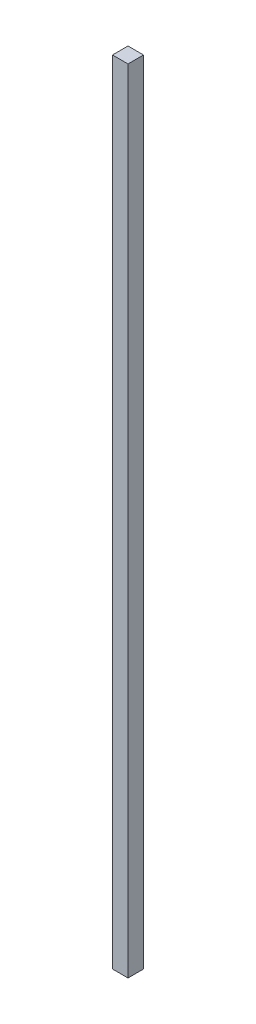
ISO-10303-21;
HEADER;
FILE_DESCRIPTION(('STEP AP214'),'2;1');
FILE_NAME('part.step','',(''),(''),'','','');
FILE_SCHEMA(('AUTOMOTIVE_DESIGN { 1 0 10303 214 1 1 1 1 }'));
ENDSEC;
DATA;
#1=APPLICATION_CONTEXT('core data for automotive mechanical design processes');
#2=APPLICATION_PROTOCOL_DEFINITION('international standard','automotive_design',2000,#1);
#3=PRODUCT_CONTEXT('',#1,'mechanical');
#4=PRODUCT('Part','Part','',(#3));
#5=PRODUCT_RELATED_PRODUCT_CATEGORY('part','',(#4));
#6=PRODUCT_DEFINITION_FORMATION('','',#4);
#7=PRODUCT_DEFINITION_CONTEXT('part definition',#1,'design');
#8=PRODUCT_DEFINITION('design','',#6,#7);
#9=PRODUCT_DEFINITION_SHAPE('','',#8);
#10=(LENGTH_UNIT() NAMED_UNIT(*) SI_UNIT(.MILLI.,.METRE.));
#11=(NAMED_UNIT(*) PLANE_ANGLE_UNIT() SI_UNIT($,.RADIAN.));
#12=(NAMED_UNIT(*) SI_UNIT($,.STERADIAN.) SOLID_ANGLE_UNIT());
#13=UNCERTAINTY_MEASURE_WITH_UNIT(LENGTH_MEASURE(1.E-05),#10,'distance_accuracy_value','');
#14=(GEOMETRIC_REPRESENTATION_CONTEXT(3) GLOBAL_UNCERTAINTY_ASSIGNED_CONTEXT((#13)) GLOBAL_UNIT_ASSIGNED_CONTEXT((#10,
#11,#12)) REPRESENTATION_CONTEXT('',''));
#15=CARTESIAN_POINT('',(0.,0.,0.));
#16=DIRECTION('',(0.,0.,1.));
#17=DIRECTION('',(1.,0.,0.));
#18=AXIS2_PLACEMENT_3D('',#15,#16,#17);
#19=CARTESIAN_POINT('',(2.5,255.,-2.5));
#20=DIRECTION('',(-1.,0.,0.));
#21=DIRECTION('',(0.,0.,1.));
#22=AXIS2_PLACEMENT_3D('',#19,#20,#21);
#23=PLANE('',#22);
#24=DIRECTION('',(0.,0.,-1.));
#25=VECTOR('',#24,1.);
#26=CARTESIAN_POINT('',(2.5,0.,-2.5));
#27=LINE('',#26,#25);
#28=CARTESIAN_POINT('',(2.5,0.,2.5));
#29=VERTEX_POINT('',#28);
#30=CARTESIAN_POINT('',(2.5,0.,-2.5));
#31=VERTEX_POINT('',#30);
#32=EDGE_CURVE('E100',#29,#31,#27,.T.);
#33=ORIENTED_EDGE('',*,*,#32,.T.);
#34=DIRECTION('',(0.,-1.,0.));
#35=VECTOR('',#34,1.);
#36=CARTESIAN_POINT('',(2.5,255.,-2.5));
#37=LINE('',#36,#35);
#38=CARTESIAN_POINT('',(2.5,255.,-2.5));
#39=VERTEX_POINT('',#38);
#40=EDGE_CURVE('E11',#39,#31,#37,.T.);
#41=ORIENTED_EDGE('',*,*,#40,.F.);
#42=DIRECTION('',(0.,0.,-1.));
#43=VECTOR('',#42,1.);
#44=CARTESIAN_POINT('',(2.5,255.,-2.5));
#45=LINE('',#44,#43);
#46=CARTESIAN_POINT('',(2.5,255.,2.5));
#47=VERTEX_POINT('',#46);
#48=EDGE_CURVE('E88',#47,#39,#45,.T.);
#49=ORIENTED_EDGE('',*,*,#48,.F.);
#50=DIRECTION('',(0.,-1.,0.));
#51=VECTOR('',#50,1.);
#52=CARTESIAN_POINT('',(2.5,255.,2.5));
#53=LINE('',#52,#51);
#54=EDGE_CURVE('E96',#47,#29,#53,.T.);
#55=ORIENTED_EDGE('',*,*,#54,.T.);
#56=EDGE_LOOP('',(#33,#41,#49,#55));
#57=FACE_BOUND('',#56,.T.);
#58=ADVANCED_FACE('F37',(#57),#23,.F.);
#59=CARTESIAN_POINT('',(-2.50000000000001,255.,-2.5));
#60=DIRECTION('',(0.,0.,1.));
#61=DIRECTION('',(1.,0.,0.));
#62=AXIS2_PLACEMENT_3D('',#59,#60,#61);
#63=PLANE('',#62);
#64=DIRECTION('',(-1.,0.,0.));
#65=VECTOR('',#64,1.);
#66=CARTESIAN_POINT('',(-2.50000000000001,0.,-2.5));
#67=LINE('',#66,#65);
#68=CARTESIAN_POINT('',(-2.50000000000001,0.,-2.5));
#69=VERTEX_POINT('',#68);
#70=EDGE_CURVE('E92',#31,#69,#67,.T.);
#71=ORIENTED_EDGE('',*,*,#70,.T.);
#72=DIRECTION('',(0.,-1.,0.));
#73=VECTOR('',#72,1.);
#74=CARTESIAN_POINT('',(-2.50000000000001,255.,-2.5));
#75=LINE('',#74,#73);
#76=CARTESIAN_POINT('',(-2.50000000000001,255.,-2.5));
#77=VERTEX_POINT('',#76);
#78=EDGE_CURVE('E45',#77,#69,#75,.T.);
#79=ORIENTED_EDGE('',*,*,#78,.F.);
#80=DIRECTION('',(-1.,0.,0.));
#81=VECTOR('',#80,1.);
#82=CARTESIAN_POINT('',(-2.50000000000001,255.,-2.5));
#83=LINE('',#82,#81);
#84=EDGE_CURVE('E83',#39,#77,#83,.T.);
#85=ORIENTED_EDGE('',*,*,#84,.F.);
#86=ORIENTED_EDGE('',*,*,#40,.T.);
#87=EDGE_LOOP('',(#71,#79,#85,#86));
#88=FACE_BOUND('',#87,.T.);
#89=ADVANCED_FACE('F91',(#88),#63,.F.);
#90=CARTESIAN_POINT('',(-2.50000000000001,255.,-2.5));
#91=DIRECTION('',(1.,0.,0.));
#92=DIRECTION('',(0.,0.,-1.));
#93=AXIS2_PLACEMENT_3D('',#90,#91,#92);
#94=PLANE('',#93);
#95=DIRECTION('',(0.,0.,1.));
#96=VECTOR('',#95,1.);
#97=CARTESIAN_POINT('',(-2.50000000000001,0.,-2.5));
#98=LINE('',#97,#96);
#99=CARTESIAN_POINT('',(-2.50000000000001,0.,2.5));
#100=VERTEX_POINT('',#99);
#101=EDGE_CURVE('E70',#69,#100,#98,.T.);
#102=ORIENTED_EDGE('',*,*,#101,.T.);
#103=DIRECTION('',(0.,-1.,0.));
#104=VECTOR('',#103,1.);
#105=CARTESIAN_POINT('',(-2.50000000000001,255.,2.5));
#106=LINE('',#105,#104);
#107=CARTESIAN_POINT('',(-2.50000000000001,255.,2.5));
#108=VERTEX_POINT('',#107);
#109=EDGE_CURVE('E93',#108,#100,#106,.T.);
#110=ORIENTED_EDGE('',*,*,#109,.F.);
#111=DIRECTION('',(0.,0.,1.));
#112=VECTOR('',#111,1.);
#113=CARTESIAN_POINT('',(-2.50000000000001,255.,-2.5));
#114=LINE('',#113,#112);
#115=EDGE_CURVE('E86',#77,#108,#114,.T.);
#116=ORIENTED_EDGE('',*,*,#115,.F.);
#117=ORIENTED_EDGE('',*,*,#78,.T.);
#118=EDGE_LOOP('',(#102,#110,#116,#117));
#119=FACE_BOUND('',#118,.T.);
#120=ADVANCED_FACE('F94',(#119),#94,.F.);
#121=CARTESIAN_POINT('',(-2.50000000000001,255.,2.5));
#122=DIRECTION('',(0.,0.,-1.));
#123=DIRECTION('',(-1.,0.,0.));
#124=AXIS2_PLACEMENT_3D('',#121,#122,#123);
#125=PLANE('',#124);
#126=DIRECTION('',(1.,0.,0.));
#127=VECTOR('',#126,1.);
#128=CARTESIAN_POINT('',(-2.50000000000001,0.,2.5));
#129=LINE('',#128,#127);
#130=EDGE_CURVE('E76',#100,#29,#129,.T.);
#131=ORIENTED_EDGE('',*,*,#130,.T.);
#132=ORIENTED_EDGE('',*,*,#54,.F.);
#133=DIRECTION('',(1.,0.,0.));
#134=VECTOR('',#133,1.);
#135=CARTESIAN_POINT('',(-2.50000000000001,255.,2.5));
#136=LINE('',#135,#134);
#137=EDGE_CURVE('E53',#108,#47,#136,.T.);
#138=ORIENTED_EDGE('',*,*,#137,.F.);
#139=ORIENTED_EDGE('',*,*,#109,.T.);
#140=EDGE_LOOP('',(#131,#132,#138,#139));
#141=FACE_BOUND('',#140,.T.);
#142=ADVANCED_FACE('F107',(#141),#125,.F.);
#143=CARTESIAN_POINT('',(0.,255.,0.));
#144=DIRECTION('',(0.,1.,0.));
#145=DIRECTION('',(0.,0.,1.));
#146=AXIS2_PLACEMENT_3D('',#143,#144,#145);
#147=PLANE('',#146);
#148=ORIENTED_EDGE('',*,*,#48,.T.);
#149=ORIENTED_EDGE('',*,*,#84,.T.);
#150=ORIENTED_EDGE('',*,*,#115,.T.);
#151=ORIENTED_EDGE('',*,*,#137,.T.);
#152=EDGE_LOOP('',(#148,#149,#150,#151));
#153=FACE_BOUND('',#152,.T.);
#154=ADVANCED_FACE('F84',(#153),#147,.T.);
#155=CARTESIAN_POINT('',(0.,0.,0.));
#156=DIRECTION('',(0.,1.,0.));
#157=DIRECTION('',(0.,0.,1.));
#158=AXIS2_PLACEMENT_3D('',#155,#156,#157);
#159=PLANE('',#158);
#160=ORIENTED_EDGE('',*,*,#32,.F.);
#161=ORIENTED_EDGE('',*,*,#130,.F.);
#162=ORIENTED_EDGE('',*,*,#101,.F.);
#163=ORIENTED_EDGE('',*,*,#70,.F.);
#164=EDGE_LOOP('',(#160,#161,#162,#163));
#165=FACE_BOUND('',#164,.T.);
#166=ADVANCED_FACE('F110',(#165),#159,.F.);
#167=CLOSED_SHELL('',(#58,#89,#120,#142,#154,#166));
#168=MANIFOLD_SOLID_BREP('B2',#167);
#169=ADVANCED_BREP_SHAPE_REPRESENTATION('',(#18,#168),#14);
#170=SHAPE_DEFINITION_REPRESENTATION(#9,#169);
ENDSEC;
END-ISO-10303-21;
